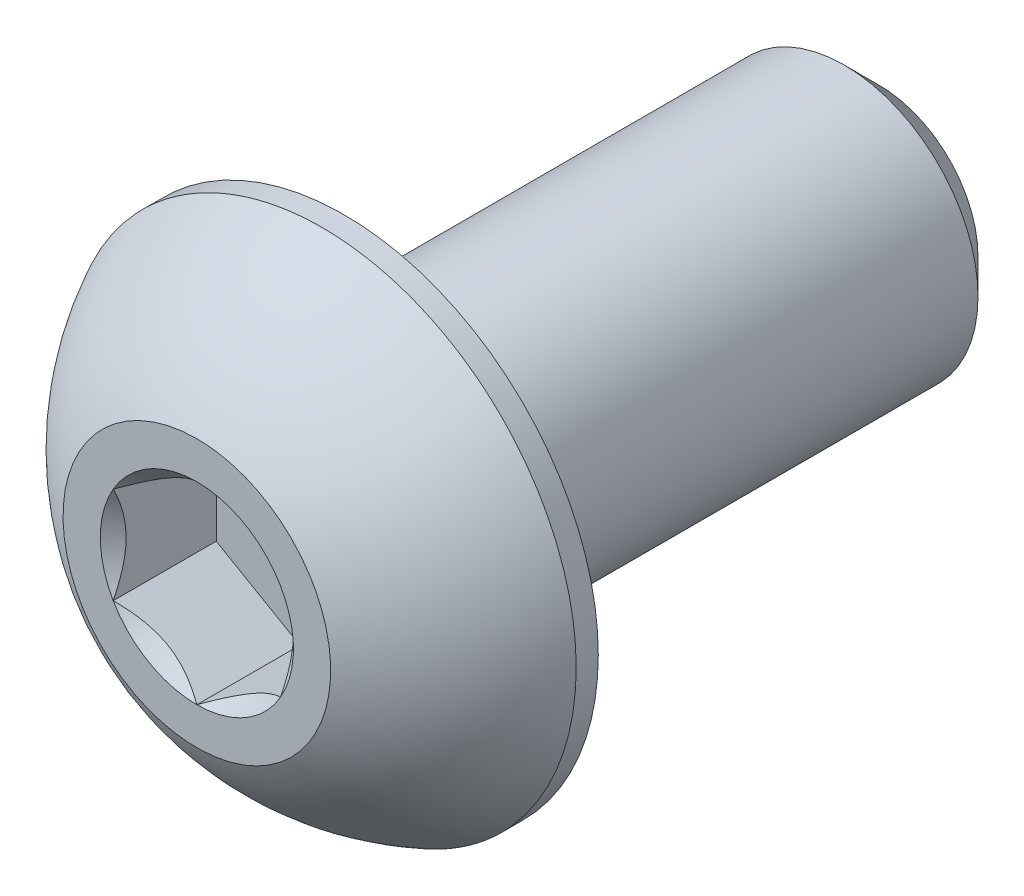
ISO-10303-21;
HEADER;
FILE_DESCRIPTION(('STEP AP214'),'2;1');
FILE_NAME('part.step','',(''),(''),'','','');
FILE_SCHEMA(('AUTOMOTIVE_DESIGN { 1 0 10303 214 1 1 1 1 }'));
ENDSEC;
DATA;
#1=APPLICATION_CONTEXT('core data for automotive mechanical design processes');
#2=APPLICATION_PROTOCOL_DEFINITION('international standard','automotive_design',2000,#1);
#3=PRODUCT_CONTEXT('',#1,'mechanical');
#4=PRODUCT('Part','Part','',(#3));
#5=PRODUCT_RELATED_PRODUCT_CATEGORY('part','',(#4));
#6=PRODUCT_DEFINITION_FORMATION('','',#4);
#7=PRODUCT_DEFINITION_CONTEXT('part definition',#1,'design');
#8=PRODUCT_DEFINITION('design','',#6,#7);
#9=PRODUCT_DEFINITION_SHAPE('','',#8);
#10=(LENGTH_UNIT() NAMED_UNIT(*) SI_UNIT(.MILLI.,.METRE.));
#11=(NAMED_UNIT(*) PLANE_ANGLE_UNIT() SI_UNIT($,.RADIAN.));
#12=(NAMED_UNIT(*) SI_UNIT($,.STERADIAN.) SOLID_ANGLE_UNIT());
#13=UNCERTAINTY_MEASURE_WITH_UNIT(LENGTH_MEASURE(1.E-05),#10,'distance_accuracy_value','');
#14=(GEOMETRIC_REPRESENTATION_CONTEXT(3) GLOBAL_UNCERTAINTY_ASSIGNED_CONTEXT((#13)) GLOBAL_UNIT_ASSIGNED_CONTEXT((#10,
#11,#12)) REPRESENTATION_CONTEXT('',''));
#15=CARTESIAN_POINT('',(0.,0.,0.));
#16=DIRECTION('',(0.,0.,1.));
#17=DIRECTION('',(1.,0.,0.));
#18=AXIS2_PLACEMENT_3D('',#15,#16,#17);
#19=CARTESIAN_POINT('',(1.25,-0.721687836487032,-1.54));
#20=DIRECTION('',(0.,0.,1.));
#21=DIRECTION('',(1.,0.,0.));
#22=AXIS2_PLACEMENT_3D('',#19,#20,#21);
#23=PLANE('',#22);
#24=DIRECTION('',(0.,1.,0.));
#25=VECTOR('',#24,1.);
#26=CARTESIAN_POINT('',(-1.25,0.721687836487032,-1.54));
#27=LINE('',#26,#25);
#28=CARTESIAN_POINT('',(-1.25,0.721687836487031,-1.54));
#29=VERTEX_POINT('',#28);
#30=CARTESIAN_POINT('',(-1.25,-0.721687836487032,-1.54));
#31=VERTEX_POINT('',#30);
#32=EDGE_CURVE('E67',#29,#31,#27,.F.);
#33=ORIENTED_EDGE('',*,*,#32,.T.);
#34=DIRECTION('',(0.866025403784439,-0.5,0.));
#35=VECTOR('',#34,1.);
#36=CARTESIAN_POINT('',(-1.25,-0.721687836487032,-1.54));
#37=LINE('',#36,#35);
#38=CARTESIAN_POINT('',(0.,-1.44337567297406,-1.54));
#39=VERTEX_POINT('',#38);
#40=EDGE_CURVE('E81',#31,#39,#37,.T.);
#41=ORIENTED_EDGE('',*,*,#40,.T.);
#42=DIRECTION('',(0.866025403784438,0.5,0.));
#43=VECTOR('',#42,1.);
#44=CARTESIAN_POINT('',(0.,-1.44337567297406,-1.54));
#45=LINE('',#44,#43);
#46=CARTESIAN_POINT('',(1.25,-0.721687836487032,-1.54));
#47=VERTEX_POINT('',#46);
#48=EDGE_CURVE('E84',#39,#47,#45,.T.);
#49=ORIENTED_EDGE('',*,*,#48,.T.);
#50=DIRECTION('',(0.,1.,0.));
#51=VECTOR('',#50,1.);
#52=CARTESIAN_POINT('',(1.25,-0.721687836487032,-1.54));
#53=LINE('',#52,#51);
#54=CARTESIAN_POINT('',(1.25,0.721687836487033,-1.54));
#55=VERTEX_POINT('',#54);
#56=EDGE_CURVE('E93',#47,#55,#53,.T.);
#57=ORIENTED_EDGE('',*,*,#56,.T.);
#58=DIRECTION('',(-0.866025403784439,0.5,0.));
#59=VECTOR('',#58,1.);
#60=CARTESIAN_POINT('',(1.25,0.721687836487033,-1.54));
#61=LINE('',#60,#59);
#62=CARTESIAN_POINT('',(0.,1.44337567297406,-1.54));
#63=VERTEX_POINT('',#62);
#64=EDGE_CURVE('E265',#55,#63,#61,.T.);
#65=ORIENTED_EDGE('',*,*,#64,.T.);
#66=DIRECTION('',(-0.866025403784438,-0.5,0.));
#67=VECTOR('',#66,1.);
#68=CARTESIAN_POINT('',(0.,1.44337567297406,-1.54));
#69=LINE('',#68,#67);
#70=EDGE_CURVE('E72',#63,#29,#69,.T.);
#71=ORIENTED_EDGE('',*,*,#70,.T.);
#72=EDGE_LOOP('',(#33,#41,#49,#57,#65,#71));
#73=FACE_BOUND('',#72,.T.);
#74=ADVANCED_FACE('F17',(#73),#23,.T.);
#75=CARTESIAN_POINT('',(-1.25,-0.721687836487032,-1.54));
#76=DIRECTION('',(-0.5,-0.866025403784439,0.));
#77=DIRECTION('',(0.866025403784439,-0.5,0.));
#78=AXIS2_PLACEMENT_3D('',#75,#76,#77);
#79=PLANE('',#78);
#80=CARTESIAN_POINT('',(-1.2500000000016,-0.721687836486111,-2.26836178063198E-12));
#81=CARTESIAN_POINT('',(-1.20703689150833,-0.74649259873992,-0.0247809602853257));
#82=CARTESIAN_POINT('',(-1.1633554359775,-0.771712098849238,-0.0481062505422106));
#83=CARTESIAN_POINT('',(-1.07428446548141,-0.823137247642137,-0.0908138610995847));
#84=CARTESIAN_POINT('',(-1.02888648449087,-0.849347784187693,-0.110172426663462));
#85=CARTESIAN_POINT('',(-0.937343688598987,-0.902200042038242,-0.143333784117164));
#86=CARTESIAN_POINT('',(-0.891222174228788,-0.92882831077531,-0.15721990325138));
#87=CARTESIAN_POINT('',(-0.79796403899848,-0.982670920254651,-0.178614098245694));
#88=CARTESIAN_POINT('',(-0.750830265050418,-1.00988361733149,-0.186138138130082));
#89=CARTESIAN_POINT('',(-0.669590913661114,-1.05678717872489,-0.192927172266352));
#90=CARTESIAN_POINT('',(-0.635590178136799,-1.0764175125325,-0.19393181141306));
#91=CARTESIAN_POINT('',(-0.567648554853576,-1.11564362702425,-0.192236504858619));
#92=CARTESIAN_POINT('',(-0.533707681972964,-1.1352393991184,-0.189535740825175));
#93=CARTESIAN_POINT('',(-0.466153619951155,-1.17424175501155,-0.180585751756811));
#94=CARTESIAN_POINT('',(-0.432540765124883,-1.19364814579373,-0.174333227052609));
#95=CARTESIAN_POINT('',(-0.365876261008733,-1.23213691519058,-0.158616460881214));
#96=CARTESIAN_POINT('',(-0.332824858931062,-1.25121915107722,-0.149150841277129));
#97=CARTESIAN_POINT('',(-0.24821357015969,-1.30006950142585,-0.121071668556236));
#98=CARTESIAN_POINT('',(-0.197186124607517,-1.32953021085146,-0.100350655055702));
#99=CARTESIAN_POINT('',(-0.0971276057052171,-1.38729902367441,-0.0536764942537948));
#100=CARTESIAN_POINT('',(-0.0480906425773457,-1.41561052753653,-0.0277403788128112));
#101=CARTESIAN_POINT('',(1.59655497120924E-12,-1.44337567297499,-2.26830546905102E-12));
#102=B_SPLINE_CURVE_WITH_KNOTS('',3,(#80,#81,#82,#83,#84,#85,#86,#87,#88,#89,#90,#91,#92,#93,
#94,#95,#96,#97,#98,#99,#100,#101),.UNSPECIFIED.,.F.,.F.,(4,2,2,2,2,2,2,2,2,2,4),(0.,
0.166478683193945,0.333926926769032,0.498716658424013,0.663091654503517,0.780745575390527,
0.89842548413854,1.01621489951224,1.13405490022132,1.3211159162831,1.5075756576265),.UNSPECIFIED.);
#103=CARTESIAN_POINT('',(-1.25000000000138,-0.72168783648783,-1.59483069292473E-12));
#104=VERTEX_POINT('',#103);
#105=CARTESIAN_POINT('',(-1.96732798956771E-12,-1.44337567297612,-1.1341344691766E-12));
#106=VERTEX_POINT('',#105);
#107=EDGE_CURVE('E20',#104,#106,#102,.T.);
#108=ORIENTED_EDGE('',*,*,#107,.T.);
#109=DIRECTION('',(0.,0.,1.));
#110=VECTOR('',#109,1.);
#111=CARTESIAN_POINT('',(0.,-1.44337567297406,-1.54));
#112=LINE('',#111,#110);
#113=EDGE_CURVE('E88',#106,#39,#112,.F.);
#114=ORIENTED_EDGE('',*,*,#113,.T.);
#115=ORIENTED_EDGE('',*,*,#40,.F.);
#116=DIRECTION('',(0.,0.,1.));
#117=VECTOR('',#116,1.);
#118=CARTESIAN_POINT('',(-1.25,-0.721687836487032,-1.54));
#119=LINE('',#118,#117);
#120=EDGE_CURVE('E59',#31,#104,#119,.T.);
#121=ORIENTED_EDGE('',*,*,#120,.T.);
#122=EDGE_LOOP('',(#108,#114,#115,#121));
#123=FACE_BOUND('',#122,.T.);
#124=ADVANCED_FACE('F89',(#123),#79,.F.);
#125=CARTESIAN_POINT('',(0.,-1.44337567297406,-1.54));
#126=DIRECTION('',(0.5,-0.866025403784438,0.));
#127=DIRECTION('',(0.866025403784438,0.5,0.));
#128=AXIS2_PLACEMENT_3D('',#125,#126,#127);
#129=PLANE('',#128);
#130=CARTESIAN_POINT('',(-1.59927432460088E-12,-1.44337567297498,-2.27031168720241E-12));
#131=CARTESIAN_POINT('',(0.0429631084916656,-1.41857091072117,-0.0247809602853281));
#132=CARTESIAN_POINT('',(0.0866445640224934,-1.39335141061186,-0.0481062505422131));
#133=CARTESIAN_POINT('',(0.175715534518584,-1.34192626181896,-0.0908138610995873));
#134=CARTESIAN_POINT('',(0.221113515509127,-1.3157157252734,-0.110172426663465));
#135=CARTESIAN_POINT('',(0.31265631140101,-1.26286346742285,-0.143333784117167));
#136=CARTESIAN_POINT('',(0.358777825771209,-1.23623519868578,-0.157219903251383));
#137=CARTESIAN_POINT('',(0.452035961001518,-1.18239258920644,-0.178614098245698));
#138=CARTESIAN_POINT('',(0.499169734949579,-1.15517989212961,-0.186138138130085));
#139=CARTESIAN_POINT('',(0.580409086338884,-1.1082763307362,-0.192927172266355));
#140=CARTESIAN_POINT('',(0.614409821863198,-1.08864599692859,-0.193931811413064));
#141=CARTESIAN_POINT('',(0.682351445146421,-1.04941988243684,-0.192236504858622));
#142=CARTESIAN_POINT('',(0.716292318027033,-1.02982411034269,-0.189535740825178));
#143=CARTESIAN_POINT('',(0.783846380048841,-0.990821754449548,-0.180585751756815));
#144=CARTESIAN_POINT('',(0.817459234875114,-0.971415363667367,-0.174333227052613));
#145=CARTESIAN_POINT('',(0.884123738991264,-0.932926594270515,-0.158616460881217));
#146=CARTESIAN_POINT('',(0.917175141068935,-0.913844358383877,-0.149150841277132));
#147=CARTESIAN_POINT('',(1.00178642984031,-0.864994008035244,-0.121071668556239));
#148=CARTESIAN_POINT('',(1.05281387539248,-0.835533298609638,-0.100350655055706));
#149=CARTESIAN_POINT('',(1.15287239429478,-0.77776448578668,-0.0536764942537982));
#150=CARTESIAN_POINT('',(1.20190935742265,-0.749452981924561,-0.0277403788128144));
#151=CARTESIAN_POINT('',(1.25000000000159,-0.721687836486107,-2.271252521862E-12));
#152=B_SPLINE_CURVE_WITH_KNOTS('',3,(#130,#131,#132,#133,#134,#135,#136,#137,#138,#139,#140,
#141,#142,#143,#144,#145,#146,#147,#148,#149,#150,#151),.UNSPECIFIED.,.F.,.F.,(4,2,2,2,2,2,2,2,
2,2,4),(0.,0.166478683193946,0.333926926769033,0.498716658424015,0.663091654503519,
0.780745575390529,0.898425484138542,1.01621489951224,1.13405490022132,1.3211159162831,
1.5075756576265),.UNSPECIFIED.);
#153=CARTESIAN_POINT('',(1.2500000000008,-0.721687836489759,-1.13558355513166E-12));
#154=VERTEX_POINT('',#153);
#155=EDGE_CURVE('E202',#106,#154,#152,.T.);
#156=ORIENTED_EDGE('',*,*,#155,.T.);
#157=DIRECTION('',(0.,0.,-1.));
#158=VECTOR('',#157,1.);
#159=CARTESIAN_POINT('',(1.25,-0.721687836487033,-1.54));
#160=LINE('',#159,#158);
#161=EDGE_CURVE('E97',#154,#47,#160,.T.);
#162=ORIENTED_EDGE('',*,*,#161,.T.);
#163=ORIENTED_EDGE('',*,*,#48,.F.);
#164=ORIENTED_EDGE('',*,*,#113,.F.);
#165=EDGE_LOOP('',(#156,#162,#163,#164));
#166=FACE_BOUND('',#165,.T.);
#167=ADVANCED_FACE('F95',(#166),#129,.F.);
#168=CARTESIAN_POINT('',(1.25,-0.721687836487032,-1.54));
#169=DIRECTION('',(1.,0.,0.));
#170=DIRECTION('',(0.,0.,-1.));
#171=AXIS2_PLACEMENT_3D('',#168,#169,#170);
#172=PLANE('',#171);
#173=CARTESIAN_POINT('',(1.25,-0.721687836488875,-2.26795896550859E-12));
#174=CARTESIAN_POINT('',(1.25,-0.672078311968734,-0.0247809602843525));
#175=CARTESIAN_POINT('',(1.25,-0.621639311737501,-0.0481062505397484));
#176=CARTESIAN_POINT('',(1.25,-0.518789014126518,-0.090813861092757));
#177=CARTESIAN_POINT('',(1.25,-0.466367941022824,-0.110172426653755));
#178=CARTESIAN_POINT('',(1.25,-0.360663425297222,-0.143333784099996));
#179=CARTESIAN_POINT('',(1.25,-0.307406887811172,-0.157219903229683));
#180=CARTESIAN_POINT('',(1.25,-0.199721668829271,-0.178614098213362));
#181=CARTESIAN_POINT('',(1.25,-0.145296274664292,-0.186138138091646));
#182=CARTESIAN_POINT('',(1.25,-0.0514891518512715,-0.192927172217059));
#183=CARTESIAN_POINT('',(1.25,-0.0122284842208856,-0.193931811358571));
#184=CARTESIAN_POINT('',(1.25,0.0662237447923831,-0.192236504792061));
#185=CARTESIAN_POINT('',(1.25,0.105415288995289,-0.189535740751742));
#186=CARTESIAN_POINT('',(1.25,0.183420000810114,-0.180585751668417));
#187=CARTESIAN_POINT('',(1.25,0.22223278238841,-0.174333226956125));
#188=CARTESIAN_POINT('',(1.25,0.29921032120936,-0.158616460767833));
#189=CARTESIAN_POINT('',(1.25,0.337374792995945,-0.149150841154941));
#190=CARTESIAN_POINT('',(1.25,0.43507549364919,-0.121071668433228));
#191=CARTESIAN_POINT('',(1.25,0.493996912445358,-0.100350654949518));
#192=CARTESIAN_POINT('',(1.25,0.609534537985814,-0.0536764941931687));
#193=CARTESIAN_POINT('',(1.25,0.666157545659631,-0.0277403787809138));
#194=CARTESIAN_POINT('',(1.25,0.721687836488875,-2.26787696339759E-12));
#195=B_SPLINE_CURVE_WITH_KNOTS('',3,(#173,#174,#175,#176,#177,#178,#179,#180,#181,#182,#183,
#184,#185,#186,#187,#188,#189,#190,#191,#192,#193,#194),.UNSPECIFIED.,.F.,.F.,(4,2,2,2,2,2,2,2,
2,2,4),(0.,0.166478683226287,0.333926926833724,0.498716658519756,0.663091654630285,
0.780745575562284,0.89842548435534,1.01621489977414,1.13405490052833,1.3211159164188,
1.50757565759031),.UNSPECIFIED.);
#196=CARTESIAN_POINT('',(1.25000000000276,0.72168783648636,-1.13395259608091E-12));
#197=VERTEX_POINT('',#196);
#198=EDGE_CURVE('E184',#154,#197,#195,.T.);
#199=ORIENTED_EDGE('',*,*,#198,.T.);
#200=DIRECTION('',(0.,0.,1.));
#201=VECTOR('',#200,1.);
#202=CARTESIAN_POINT('',(1.25,0.721687836487033,-1.54));
#203=LINE('',#202,#201);
#204=EDGE_CURVE('E262',#197,#55,#203,.F.);
#205=ORIENTED_EDGE('',*,*,#204,.T.);
#206=ORIENTED_EDGE('',*,*,#56,.F.);
#207=ORIENTED_EDGE('',*,*,#161,.F.);
#208=EDGE_LOOP('',(#199,#205,#206,#207));
#209=FACE_BOUND('',#208,.T.);
#210=ADVANCED_FACE('F174',(#209),#172,.F.);
#211=CARTESIAN_POINT('',(1.25,0.721687836487033,-1.54));
#212=DIRECTION('',(0.5,0.866025403784439,0.));
#213=DIRECTION('',(-0.866025403784439,0.5,0.));
#214=AXIS2_PLACEMENT_3D('',#211,#212,#213);
#215=PLANE('',#214);
#216=CARTESIAN_POINT('',(1.2500000000016,0.721687836486112,-2.26779275057892E-12));
#217=CARTESIAN_POINT('',(1.20703689150833,0.746492598739921,-0.0247809602853253));
#218=CARTESIAN_POINT('',(1.1633554359775,0.771712098849239,-0.0481062505422101));
#219=CARTESIAN_POINT('',(1.07428446548141,0.823137247642138,-0.090813861099584));
#220=CARTESIAN_POINT('',(1.02888648449087,0.849347784187694,-0.110172426663462));
#221=CARTESIAN_POINT('',(0.937343688598988,0.902200042038243,-0.143333784117164));
#222=CARTESIAN_POINT('',(0.891222174228788,0.928828310775311,-0.157219903251379));
#223=CARTESIAN_POINT('',(0.79796403899848,0.982670920254652,-0.178614098245693));
#224=CARTESIAN_POINT('',(0.750830265050419,1.00988361733149,-0.186138138130081));
#225=CARTESIAN_POINT('',(0.669590913661114,1.05678717872489,-0.192927172266351));
#226=CARTESIAN_POINT('',(0.6355901781368,1.0764175125325,-0.193931811413059));
#227=CARTESIAN_POINT('',(0.567648554853577,1.11564362702425,-0.192236504858618));
#228=CARTESIAN_POINT('',(0.533707681972964,1.1352393991184,-0.189535740825174));
#229=CARTESIAN_POINT('',(0.466153619951156,1.17424175501155,-0.18058575175681));
#230=CARTESIAN_POINT('',(0.432540765124884,1.19364814579373,-0.174333227052608));
#231=CARTESIAN_POINT('',(0.365876261008733,1.23213691519058,-0.158616460881213));
#232=CARTESIAN_POINT('',(0.332824858931062,1.25121915107722,-0.149150841277128));
#233=CARTESIAN_POINT('',(0.24821357015969,1.30006950142585,-0.121071668556235));
#234=CARTESIAN_POINT('',(0.197186124607517,1.32953021085146,-0.100350655055701));
#235=CARTESIAN_POINT('',(0.0971276057052179,1.38729902367441,-0.0536764942537943));
#236=CARTESIAN_POINT('',(0.0480906425773466,1.41561052753653,-0.0277403788128107));
#237=CARTESIAN_POINT('',(-1.59549932784665E-12,1.44337567297499,-2.26778926334573E-12));
#238=B_SPLINE_CURVE_WITH_KNOTS('',3,(#216,#217,#218,#219,#220,#221,#222,#223,#224,#225,#226,
#227,#228,#229,#230,#231,#232,#233,#234,#235,#236,#237),.UNSPECIFIED.,.F.,.F.,(4,2,2,2,2,2,2,2,
2,2,4),(0.,0.166478683193945,0.333926926769031,0.498716658424013,0.663091654503517,
0.780745575390526,0.898425484138539,1.01621489951224,1.13405490022132,1.32111591628309,
1.5075756576265),.UNSPECIFIED.);
#239=CARTESIAN_POINT('',(1.96785442637201E-12,1.44337567297612,-1.1338136091029E-12));
#240=VERTEX_POINT('',#239);
#241=EDGE_CURVE('E178',#197,#240,#238,.T.);
#242=ORIENTED_EDGE('',*,*,#241,.T.);
#243=DIRECTION('',(0.,0.,1.));
#244=VECTOR('',#243,1.);
#245=CARTESIAN_POINT('',(0.,1.44337567297406,-1.54));
#246=LINE('',#245,#244);
#247=EDGE_CURVE('E257',#240,#63,#246,.F.);
#248=ORIENTED_EDGE('',*,*,#247,.T.);
#249=ORIENTED_EDGE('',*,*,#64,.F.);
#250=ORIENTED_EDGE('',*,*,#204,.F.);
#251=EDGE_LOOP('',(#242,#248,#249,#250));
#252=FACE_BOUND('',#251,.T.);
#253=ADVANCED_FACE('F170',(#252),#215,.F.);
#254=CARTESIAN_POINT('',(0.,1.44337567297406,-1.54));
#255=DIRECTION('',(-0.5,0.866025403784438,0.));
#256=DIRECTION('',(-0.866025403784438,-0.5,0.));
#257=AXIS2_PLACEMENT_3D('',#254,#255,#256);
#258=PLANE('',#257);
#259=CARTESIAN_POINT('',(1.59942300893385E-12,1.44337567297498,-2.27020150660554E-12));
#260=CARTESIAN_POINT('',(-0.0429631084916655,1.41857091072117,-0.024780960285328));
#261=CARTESIAN_POINT('',(-0.0866445640224934,1.39335141061186,-0.048106250542213));
#262=CARTESIAN_POINT('',(-0.175715534518584,1.34192626181896,-0.0908138610995872));
#263=CARTESIAN_POINT('',(-0.221113515509127,1.3157157252734,-0.110172426663465));
#264=CARTESIAN_POINT('',(-0.31265631140101,1.26286346742285,-0.143333784117167));
#265=CARTESIAN_POINT('',(-0.358777825771209,1.23623519868578,-0.157219903251383));
#266=CARTESIAN_POINT('',(-0.452035961001517,1.18239258920644,-0.178614098245697));
#267=CARTESIAN_POINT('',(-0.499169734949579,1.15517989212961,-0.186138138130085));
#268=CARTESIAN_POINT('',(-0.580409086338884,1.1082763307362,-0.192927172266355));
#269=CARTESIAN_POINT('',(-0.614409821863198,1.08864599692859,-0.193931811413064));
#270=CARTESIAN_POINT('',(-0.682351445146421,1.04941988243684,-0.192236504858623));
#271=CARTESIAN_POINT('',(-0.716292318027033,1.02982411034269,-0.189535740825178));
#272=CARTESIAN_POINT('',(-0.783846380048841,0.990821754449548,-0.180585751756815));
#273=CARTESIAN_POINT('',(-0.817459234875113,0.971415363667368,-0.174333227052613));
#274=CARTESIAN_POINT('',(-0.884123738991264,0.932926594270515,-0.158616460881218));
#275=CARTESIAN_POINT('',(-0.917175141068934,0.913844358383877,-0.149150841277132));
#276=CARTESIAN_POINT('',(-1.00178642984031,0.864994008035244,-0.121071668556239));
#277=CARTESIAN_POINT('',(-1.05281387539248,0.835533298609638,-0.100350655055706));
#278=CARTESIAN_POINT('',(-1.15287239429478,0.77776448578668,-0.0536764942537981));
#279=CARTESIAN_POINT('',(-1.20190935742265,0.749452981924561,-0.0277403788128142));
#280=CARTESIAN_POINT('',(-1.2500000000016,0.721687836486107,-2.27090905106569E-12));
#281=B_SPLINE_CURVE_WITH_KNOTS('',3,(#259,#260,#261,#262,#263,#264,#265,#266,#267,#268,#269,
#270,#271,#272,#273,#274,#275,#276,#277,#278,#279,#280),.UNSPECIFIED.,.F.,.F.,(4,2,2,2,2,2,2,2,
2,2,4),(0.,0.166478683193946,0.333926926769033,0.498716658424015,0.663091654503519,
0.780745575390529,0.898425484138542,1.01621489951224,1.13405490022132,1.3211159162831,
1.5075756576265),.UNSPECIFIED.);
#282=CARTESIAN_POINT('',(-1.2500000000008,0.721687836489759,-1.13546932469246E-12));
#283=VERTEX_POINT('',#282);
#284=EDGE_CURVE('E40',#240,#283,#281,.T.);
#285=ORIENTED_EDGE('',*,*,#284,.T.);
#286=DIRECTION('',(0.,0.,1.));
#287=VECTOR('',#286,1.);
#288=CARTESIAN_POINT('',(-1.25,0.721687836487032,-1.54));
#289=LINE('',#288,#287);
#290=EDGE_CURVE('E250',#283,#29,#289,.F.);
#291=ORIENTED_EDGE('',*,*,#290,.T.);
#292=ORIENTED_EDGE('',*,*,#70,.F.);
#293=ORIENTED_EDGE('',*,*,#247,.F.);
#294=EDGE_LOOP('',(#285,#291,#292,#293));
#295=FACE_BOUND('',#294,.T.);
#296=ADVANCED_FACE('F163',(#295),#258,.F.);
#297=CARTESIAN_POINT('',(-1.25,0.721687836487032,-1.54));
#298=DIRECTION('',(-1.,0.,0.));
#299=DIRECTION('',(0.,0.,1.));
#300=AXIS2_PLACEMENT_3D('',#297,#298,#299);
#301=PLANE('',#300);
#302=CARTESIAN_POINT('',(-1.25,0.721687836488874,-2.26828266931606E-12));
#303=CARTESIAN_POINT('',(-1.25,0.672078311968734,-0.0247809602843528));
#304=CARTESIAN_POINT('',(-1.25,0.6216393117375,-0.0481062505397487));
#305=CARTESIAN_POINT('',(-1.25,0.518789014126518,-0.0908138610927572));
#306=CARTESIAN_POINT('',(-1.25,0.466367941022823,-0.110172426653755));
#307=CARTESIAN_POINT('',(-1.25,0.360663425297222,-0.143333784099996));
#308=CARTESIAN_POINT('',(-1.25,0.307406887811172,-0.157219903229683));
#309=CARTESIAN_POINT('',(-1.25,0.199721668829271,-0.178614098213362));
#310=CARTESIAN_POINT('',(-1.25,0.145296274664291,-0.186138138091646));
#311=CARTESIAN_POINT('',(-1.25,0.0514891518512714,-0.192927172217059));
#312=CARTESIAN_POINT('',(-1.25,0.0122284842208855,-0.193931811358571));
#313=CARTESIAN_POINT('',(-1.25,-0.0662237447923832,-0.192236504792061));
#314=CARTESIAN_POINT('',(-1.25,-0.105415288995289,-0.189535740751742));
#315=CARTESIAN_POINT('',(-1.25,-0.183420000810114,-0.180585751668417));
#316=CARTESIAN_POINT('',(-1.25,-0.22223278238841,-0.174333226956125));
#317=CARTESIAN_POINT('',(-1.25,-0.29921032120936,-0.158616460767833));
#318=CARTESIAN_POINT('',(-1.25,-0.337374792995945,-0.149150841154941));
#319=CARTESIAN_POINT('',(-1.25,-0.43507549364919,-0.121071668433228));
#320=CARTESIAN_POINT('',(-1.25,-0.493996912445358,-0.100350654949518));
#321=CARTESIAN_POINT('',(-1.25,-0.609534537985814,-0.0536764941931687));
#322=CARTESIAN_POINT('',(-1.25,-0.666157545659631,-0.0277403787809137));
#323=CARTESIAN_POINT('',(-1.25,-0.721687836488875,-2.26787707066826E-12));
#324=B_SPLINE_CURVE_WITH_KNOTS('',3,(#302,#303,#304,#305,#306,#307,#308,#309,#310,#311,#312,
#313,#314,#315,#316,#317,#318,#319,#320,#321,#322,#323),.UNSPECIFIED.,.F.,.F.,(4,2,2,2,2,2,2,2,
2,2,4),(0.,0.166478683226287,0.333926926833723,0.498716658519755,0.663091654630285,
0.780745575562283,0.89842548435534,1.01621489977414,1.13405490052833,1.3211159164188,
1.50757565759031),.UNSPECIFIED.);
#325=EDGE_CURVE('E143',#283,#104,#324,.T.);
#326=ORIENTED_EDGE('',*,*,#325,.T.);
#327=ORIENTED_EDGE('',*,*,#120,.F.);
#328=ORIENTED_EDGE('',*,*,#32,.F.);
#329=ORIENTED_EDGE('',*,*,#290,.F.);
#330=EDGE_LOOP('',(#326,#327,#328,#329));
#331=FACE_BOUND('',#330,.T.);
#332=ADVANCED_FACE('F159',(#331),#301,.F.);
#333=CARTESIAN_POINT('',(0.,0.,-5.6843418860808E-11));
#334=DIRECTION('',(0.,0.,1.));
#335=DIRECTION('',(1.,0.,0.));
#336=AXIS2_PLACEMENT_3D('',#333,#334,#335);
#337=CONICAL_SURFACE('',#336,1.44337567292041,0.78539816325135);
#338=ORIENTED_EDGE('',*,*,#107,.F.);
#339=CARTESIAN_POINT('',(0.,0.,0.));
#340=DIRECTION('',(0.,0.,1.));
#341=DIRECTION('',(1.,0.,0.));
#342=AXIS2_PLACEMENT_3D('',#339,#340,#341);
#343=CIRCLE('',#342,1.44337567297725);
#344=EDGE_CURVE('E151',#104,#106,#343,.T.);
#345=ORIENTED_EDGE('',*,*,#344,.T.);
#346=EDGE_LOOP('',(#338,#345));
#347=FACE_BOUND('',#346,.T.);
#348=ADVANCED_FACE('F162',(#347),#337,.F.);
#349=CARTESIAN_POINT('',(0.,0.,-5.6843418860808E-11));
#350=DIRECTION('',(0.,0.,1.));
#351=DIRECTION('',(1.,0.,0.));
#352=AXIS2_PLACEMENT_3D('',#349,#350,#351);
#353=CONICAL_SURFACE('',#352,1.44337567292041,0.78539816325135);
#354=ORIENTED_EDGE('',*,*,#155,.F.);
#355=CARTESIAN_POINT('',(0.,0.,0.));
#356=DIRECTION('',(0.,0.,1.));
#357=DIRECTION('',(1.,0.,0.));
#358=AXIS2_PLACEMENT_3D('',#355,#356,#357);
#359=CIRCLE('',#358,1.44337567297725);
#360=EDGE_CURVE('E303',#106,#154,#359,.T.);
#361=ORIENTED_EDGE('',*,*,#360,.T.);
#362=EDGE_LOOP('',(#354,#361));
#363=FACE_BOUND('',#362,.T.);
#364=ADVANCED_FACE('F197',(#363),#353,.F.);
#365=CARTESIAN_POINT('',(0.,0.,-5.6843418860808E-11));
#366=DIRECTION('',(0.,0.,1.));
#367=DIRECTION('',(1.,0.,0.));
#368=AXIS2_PLACEMENT_3D('',#365,#366,#367);
#369=CONICAL_SURFACE('',#368,1.44337567292041,0.785398163397448);
#370=CARTESIAN_POINT('',(0.,0.,0.));
#371=DIRECTION('',(0.,0.,1.));
#372=DIRECTION('',(1.,0.,0.));
#373=AXIS2_PLACEMENT_3D('',#370,#371,#372);
#374=CIRCLE('',#373,1.44337567297725);
#375=EDGE_CURVE('E304',#154,#197,#374,.T.);
#376=ORIENTED_EDGE('',*,*,#375,.T.);
#377=ORIENTED_EDGE('',*,*,#198,.F.);
#378=EDGE_LOOP('',(#376,#377));
#379=FACE_BOUND('',#378,.T.);
#380=ADVANCED_FACE('F193',(#379),#369,.F.);
#381=CARTESIAN_POINT('',(0.,0.,-5.6843418860808E-11));
#382=DIRECTION('',(0.,0.,1.));
#383=DIRECTION('',(1.,0.,0.));
#384=AXIS2_PLACEMENT_3D('',#381,#382,#383);
#385=CONICAL_SURFACE('',#384,1.44337567292041,0.78539816325135);
#386=ORIENTED_EDGE('',*,*,#241,.F.);
#387=CARTESIAN_POINT('',(0.,0.,0.));
#388=DIRECTION('',(0.,0.,1.));
#389=DIRECTION('',(1.,0.,0.));
#390=AXIS2_PLACEMENT_3D('',#387,#388,#389);
#391=CIRCLE('',#390,1.44337567297725);
#392=EDGE_CURVE('E305',#197,#240,#391,.T.);
#393=ORIENTED_EDGE('',*,*,#392,.T.);
#394=EDGE_LOOP('',(#386,#393));
#395=FACE_BOUND('',#394,.T.);
#396=ADVANCED_FACE('F190',(#395),#385,.F.);
#397=CARTESIAN_POINT('',(0.,0.,-5.6843418860808E-11));
#398=DIRECTION('',(0.,0.,1.));
#399=DIRECTION('',(1.,0.,0.));
#400=AXIS2_PLACEMENT_3D('',#397,#398,#399);
#401=CONICAL_SURFACE('',#400,1.44337567292041,0.78539816325135);
#402=ORIENTED_EDGE('',*,*,#284,.F.);
#403=CARTESIAN_POINT('',(0.,0.,0.));
#404=DIRECTION('',(0.,0.,1.));
#405=DIRECTION('',(1.,0.,0.));
#406=AXIS2_PLACEMENT_3D('',#403,#404,#405);
#407=CIRCLE('',#406,1.44337567297725);
#408=EDGE_CURVE('E298',#240,#283,#407,.T.);
#409=ORIENTED_EDGE('',*,*,#408,.T.);
#410=EDGE_LOOP('',(#402,#409));
#411=FACE_BOUND('',#410,.T.);
#412=ADVANCED_FACE('F138',(#411),#401,.F.);
#413=CARTESIAN_POINT('',(0.,0.,-5.6843418860808E-11));
#414=DIRECTION('',(0.,0.,1.));
#415=DIRECTION('',(1.,0.,0.));
#416=AXIS2_PLACEMENT_3D('',#413,#414,#415);
#417=CONICAL_SURFACE('',#416,1.44337567292041,0.785398163397448);
#418=ORIENTED_EDGE('',*,*,#325,.F.);
#419=CARTESIAN_POINT('',(0.,0.,0.));
#420=DIRECTION('',(0.,0.,1.));
#421=DIRECTION('',(1.,0.,0.));
#422=AXIS2_PLACEMENT_3D('',#419,#420,#421);
#423=CIRCLE('',#422,1.44337567297725);
#424=EDGE_CURVE('E123',#283,#104,#423,.T.);
#425=ORIENTED_EDGE('',*,*,#424,.T.);
#426=EDGE_LOOP('',(#418,#425));
#427=FACE_BOUND('',#426,.T.);
#428=ADVANCED_FACE('F133',(#427),#417,.F.);
#429=CARTESIAN_POINT('',(0.,-2.,0.));
#430=DIRECTION('',(0.,0.,-1.));
#431=DIRECTION('',(-1.,0.,0.));
#432=AXIS2_PLACEMENT_3D('',#429,#430,#431);
#433=PLANE('',#432);
#434=ORIENTED_EDGE('',*,*,#408,.F.);
#435=ORIENTED_EDGE('',*,*,#392,.F.);
#436=ORIENTED_EDGE('',*,*,#375,.F.);
#437=ORIENTED_EDGE('',*,*,#360,.F.);
#438=ORIENTED_EDGE('',*,*,#344,.F.);
#439=ORIENTED_EDGE('',*,*,#424,.F.);
#440=EDGE_LOOP('',(#434,#435,#436,#437,#438,#439));
#441=FACE_BOUND('',#440,.T.);
#442=CARTESIAN_POINT('',(0.,2.00000000000001,0.));
#443=CARTESIAN_POINT('',(-0.11234088393291,1.99999501830892,0.));
#444=CARTESIAN_POINT('',(-0.224763225593508,1.99050288387283,2.68231530173461E-13));
#445=CARTESIAN_POINT('',(-0.446511726793878,1.95276859922379,-2.68988498544959E-13));
#446=CARTESIAN_POINT('',(-0.555833994612156,1.92450388247339,-1.01742638839415E-12));
#447=CARTESIAN_POINT('',(-0.768137698049009,1.85002906418694,-9.04674133920845E-13));
#448=CARTESIAN_POINT('',(-0.87112213481957,1.80382753320623,0.));
#449=CARTESIAN_POINT('',(-1.06784380972381,1.69480235085555,0.));
#450=CARTESIAN_POINT('',(-1.1615833392864,1.63198283268135,-7.28149767983077E-13));
#451=CARTESIAN_POINT('',(-1.33719709830381,1.49149220719557,-8.66068322015696E-13));
#452=CARTESIAN_POINT('',(-1.41907008513778,1.41381954648974,-2.31882612333537E-13));
#453=CARTESIAN_POINT('',(-1.56861687177599,1.24582829627508,2.31458026871751E-13));
#454=CARTESIAN_POINT('',(-1.63629011398113,1.1555092103954,0.));
#455=CARTESIAN_POINT('',(-1.75551140838451,0.964793228617698,0.));
#456=CARTESIAN_POINT('',(-1.80705976087957,0.864396520443115,0.));
#457=CARTESIAN_POINT('',(-1.89256952340774,0.656374060165244,0.));
#458=CARTESIAN_POINT('',(-1.92653096880461,0.548748322598581,0.));
#459=CARTESIAN_POINT('',(-1.97590307610689,0.329322588612879,0.));
#460=CARTESIAN_POINT('',(-1.99131370264776,0.217522584236603,0.));
#461=CARTESIAN_POINT('',(-2.0031465752584,-0.00707760750866498,0.));
#462=CARTESIAN_POINT('',(-1.99956885554327,-0.119877793075065,0.));
#463=CARTESIAN_POINT('',(-1.97352667238582,-0.343276528884565,0.));
#464=CARTESIAN_POINT('',(-1.95106220189598,-0.453875078306117,0.));
#465=CARTESIAN_POINT('',(-1.88788417341462,-0.669731048185599,0.));
#466=CARTESIAN_POINT('',(-1.84717059615922,-0.774988463005262,0.));
#467=CARTESIAN_POINT('',(-1.74865010522096,-0.977174053294477,0.));
#468=CARTESIAN_POINT('',(-1.69084319710064,-1.07410223147453,0.));
#469=CARTESIAN_POINT('',(-1.55977703496566,-1.25687784284643,0.));
#470=CARTESIAN_POINT('',(-1.48651778720561,-1.34272528052337,0.));
#471=CARTESIAN_POINT('',(-1.32662653450796,-1.50090251249222,0.));
#472=CARTESIAN_POINT('',(-1.23999452773775,-1.57323230493165,0.));
#473=CARTESIAN_POINT('',(-1.0558169799055,-1.70232101036836,0.));
#474=CARTESIAN_POINT('',(-0.958271437417255,-1.7590799213308,0.));
#475=CARTESIAN_POINT('',(-0.755035863250454,-1.85541563039959,0.));
#476=CARTESIAN_POINT('',(-0.649345831920616,-1.89499242924161,0.));
#477=CARTESIAN_POINT('',(-0.432821510670026,-1.95584044724503,0.));
#478=CARTESIAN_POINT('',(-0.321987220981025,-1.97711166723111,0.));
#479=CARTESIAN_POINT('',(-0.0983206380605834,-2.00074470318098,0.));
#480=CARTESIAN_POINT('',(0.0145116551708554,-2.00310651914479,2.77232105836669E-13));
#481=CARTESIAN_POINT('',(0.238971273328259,-1.98885370171909,-2.77665799204907E-13));
#482=CARTESIAN_POINT('',(0.350598598199939,-1.97223906747468,-1.03620566849867E-12));
#483=CARTESIAN_POINT('',(0.569479507471833,-1.9205049877507,-9.10154068848724E-13));
#484=CARTESIAN_POINT('',(0.676733091684775,-1.8853855414788,0.));
#485=CARTESIAN_POINT('',(0.883821886677241,-1.79763878093744,0.));
#486=CARTESIAN_POINT('',(0.98365709842622,-1.74501146895596,-8.08771094430417E-13));
#487=CARTESIAN_POINT('',(1.17307512321429,-1.62374291867218,-9.48503777159588E-13));
#488=CARTESIAN_POINT('',(1.26265793765837,-1.55510168256445,-2.54336729495504E-13));
#489=CARTESIAN_POINT('',(1.42902822576512,-1.40375377143032,2.53903151485753E-13));
#490=CARTESIAN_POINT('',(1.50581569424864,-1.32104709071072,0.));
#491=CARTESIAN_POINT('',(1.64441549755368,-1.14391608106199,0.));
#492=CARTESIAN_POINT('',(1.70622782750198,-1.04949174831971,0.));
#493=CARTESIAN_POINT('',(1.81312259248704,-0.851605992808598,0.));
#494=CARTESIAN_POINT('',(1.85820504518396,-0.748144579579489,0.));
#495=CARTESIAN_POINT('',(1.93036037779898,-0.535121579788185,0.));
#496=CARTESIAN_POINT('',(1.95743326443729,-0.425559995502261,0.));
#497=CARTESIAN_POINT('',(1.99280100395234,-0.203446542492708,0.));
#498=CARTESIAN_POINT('',(2.0010958229928,-0.0908946683812319,0.));
#499=CARTESIAN_POINT('',(1.99867186914418,0.134003935799382,0.));
#500=CARTESIAN_POINT('',(1.98795313250171,0.246350666259188,0.));
#501=CARTESIAN_POINT('',(1.94780635101611,0.467650235630702,0.));
#502=CARTESIAN_POINT('',(1.91837826855213,0.576603067717478,0.));
#503=CARTESIAN_POINT('',(1.8416474943685,0.788023717224041,0.));
#504=CARTESIAN_POINT('',(1.7943444697509,0.890491413824964,0.));
#505=CARTESIAN_POINT('',(1.68320860722374,1.08602688785112,0.));
#506=CARTESIAN_POINT('',(1.619376418337,1.17909503415324,0.));
#507=CARTESIAN_POINT('',(1.47700183277596,1.35318491206687,0.));
#508=CARTESIAN_POINT('',(1.39846097592721,1.43420790307402,0.));
#509=CARTESIAN_POINT('',(1.22886860673971,1.58193852304531,0.));
#510=CARTESIAN_POINT('',(1.13781398977335,1.64864258897123,0.));
#511=CARTESIAN_POINT('',(0.945762980525371,1.76584229417066,0.));
#512=CARTESIAN_POINT('',(0.844761862199248,1.81633017935908,0.));
#513=CARTESIAN_POINT('',(0.635796194547816,1.89957454112381,0.));
#514=CARTESIAN_POINT('',(0.527840167198475,1.93235227258273,0.));
#515=CARTESIAN_POINT('',(0.349330109791193,1.97050988941558,0.));
#516=CARTESIAN_POINT('',(0.279935998206567,1.9815548792951,0.));
#517=CARTESIAN_POINT('',(0.140371860834154,1.99630149111707,0.));
#518=CARTESIAN_POINT('',(0.0702018350463658,2.00000311305951,0.));
#519=CARTESIAN_POINT('',(0.,2.00000000000001,0.));
#520=B_SPLINE_CURVE_WITH_KNOTS('',3,(#442,#443,#444,#445,#446,#447,#448,#449,#450,#451,#452,
#453,#454,#455,#456,#457,#458,#459,#460,#461,#462,#463,#464,#465,#466,#467,#468,#469,#470,#471,
#472,#473,#474,#475,#476,#477,#478,#479,#480,#481,#482,#483,#484,#485,#486,#487,#488,#489,#490,
#491,#492,#493,#494,#495,#496,#497,#498,#499,#500,#501,#502,#503,#504,#505,#506,#507,#508,#509,
#510,#511,#512,#513,#514,#515,#516,#517,#518,#519),.UNSPECIFIED.,.T.,.F.,(4,2,2,2,2,2,2,2,2,2,2,
2,2,2,2,2,2,2,2,2,2,2,2,2,2,2,2,2,2,2,2,2,2,2,2,2,2,2,4),(0.,0.33676641524773,0.673938392179689,
1.01094945973899,1.34787678519445,1.6848393669933,2.0218151782471,2.35878471356387,
2.69575357129967,3.03272307141854,3.36969196435223,3.70666098302471,4.04363035740479,
4.38059962212795,4.71756875045735,5.05453792496556,5.39150714350992,5.72847634762653,
6.06544553656248,6.40241472549815,6.73938392961448,7.07635314815889,7.41332232266712,
7.75029145099701,8.08726071572075,8.42423009010089,8.76119910877332,9.09816800170696,
9.43513750182588,9.77210635956171,10.1090758948784,10.4460517061317,10.7830142879301,
11.1199416133858,11.4569526809455,11.7941246578778,12.1308910731258,12.3413364560062,
12.5517818388866),.UNSPECIFIED.);
#521=CARTESIAN_POINT('',(0.,2.00000000000001,0.));
#522=VERTEX_POINT('',#521);
#523=EDGE_CURVE('E115',#522,#522,#520,.F.);
#524=ORIENTED_EDGE('',*,*,#523,.F.);
#525=EDGE_LOOP('',(#524));
#526=FACE_BOUND('',#525,.T.);
#527=ADVANCED_FACE('F129',(#441,#526),#433,.F.);
#528=CARTESIAN_POINT('',(0.,0.,-3.72644385026738));
#529=DIRECTION('',(0.,-1.,0.));
#530=DIRECTION('',(0.,0.,-1.));
#531=AXIS2_PLACEMENT_3D('',#528,#529,#530);
#532=SPHERICAL_SURFACE('',#531,4.22922968981298);
#533=ORIENTED_EDGE('',*,*,#523,.T.);
#534=EDGE_LOOP('',(#533));
#535=FACE_BOUND('',#534,.T.);
#536=CARTESIAN_POINT('',(0.,0.,-1.87));
#537=DIRECTION('',(0.,0.,1.));
#538=DIRECTION('',(1.,0.,0.));
#539=AXIS2_PLACEMENT_3D('',#536,#537,#538);
#540=CIRCLE('',#539,3.8);
#541=CARTESIAN_POINT('',(3.8,0.,-1.87));
#542=VERTEX_POINT('',#541);
#543=EDGE_CURVE('E112',#542,#542,#540,.F.);
#544=ORIENTED_EDGE('',*,*,#543,.F.);
#545=EDGE_LOOP('',(#544));
#546=FACE_BOUND('',#545,.T.);
#547=ADVANCED_FACE('F125',(#535,#546),#532,.T.);
#548=CARTESIAN_POINT('',(0.,-2.,-10.2));
#549=DIRECTION('',(0.,0.,-1.));
#550=DIRECTION('',(0.,1.,0.));
#551=AXIS2_PLACEMENT_3D('',#548,#549,#550);
#552=PLANE('',#551);
#553=CARTESIAN_POINT('',(0.,0.,-10.1999999999975));
#554=DIRECTION('',(0.,0.,1.));
#555=DIRECTION('',(1.,0.,0.));
#556=AXIS2_PLACEMENT_3D('',#553,#554,#555);
#557=CIRCLE('',#556,1.47500000002765);
#558=CARTESIAN_POINT('',(1.47500000002765,0.,-10.1999999999975));
#559=VERTEX_POINT('',#558);
#560=EDGE_CURVE('E109',#559,#559,#557,.T.);
#561=ORIENTED_EDGE('',*,*,#560,.F.);
#562=EDGE_LOOP('',(#561));
#563=FACE_BOUND('',#562,.T.);
#564=ADVANCED_FACE('F233',(#563),#552,.T.);
#565=CARTESIAN_POINT('',(0.,0.,0.));
#566=DIRECTION('',(0.,0.,1.));
#567=DIRECTION('',(1.,0.,0.));
#568=AXIS2_PLACEMENT_3D('',#565,#566,#567);
#569=CYLINDRICAL_SURFACE('',#568,3.8);
#570=CARTESIAN_POINT('',(0.,0.,-2.2));
#571=DIRECTION('',(0.,0.,1.));
#572=DIRECTION('',(1.,0.,0.));
#573=AXIS2_PLACEMENT_3D('',#570,#571,#572);
#574=CIRCLE('',#573,3.8);
#575=CARTESIAN_POINT('',(3.8,0.,-2.2));
#576=VERTEX_POINT('',#575);
#577=EDGE_CURVE('E106',#576,#576,#574,.T.);
#578=ORIENTED_EDGE('',*,*,#577,.T.);
#579=EDGE_LOOP('',(#578));
#580=FACE_BOUND('',#579,.T.);
#581=ORIENTED_EDGE('',*,*,#543,.T.);
#582=EDGE_LOOP('',(#581));
#583=FACE_BOUND('',#582,.T.);
#584=ADVANCED_FACE('F230',(#580,#583),#569,.T.);
#585=CARTESIAN_POINT('',(0.,0.,-9.67500000007249));
#586=DIRECTION('',(0.,0.,1.));
#587=DIRECTION('',(1.,0.,0.));
#588=AXIS2_PLACEMENT_3D('',#585,#586,#587);
#589=CONICAL_SURFACE('',#588,1.99999999995271,0.785398163397449);
#590=ORIENTED_EDGE('',*,*,#560,.T.);
#591=EDGE_LOOP('',(#590));
#592=FACE_BOUND('',#591,.T.);
#593=CARTESIAN_POINT('',(0.,0.,-9.675));
#594=DIRECTION('',(0.,0.,-1.));
#595=DIRECTION('',(0.,1.,0.));
#596=AXIS2_PLACEMENT_3D('',#593,#594,#595);
#597=CIRCLE('',#596,2.);
#598=CARTESIAN_POINT('',(0.,2.,-9.675));
#599=VERTEX_POINT('',#598);
#600=EDGE_CURVE('E31',#599,#599,#597,.F.);
#601=ORIENTED_EDGE('',*,*,#600,.F.);
#602=EDGE_LOOP('',(#601));
#603=FACE_BOUND('',#602,.T.);
#604=ADVANCED_FACE('F223',(#592,#603),#589,.T.);
#605=CARTESIAN_POINT('',(0.,-3.8,-2.2));
#606=DIRECTION('',(0.,0.,1.));
#607=DIRECTION('',(1.,0.,0.));
#608=AXIS2_PLACEMENT_3D('',#605,#606,#607);
#609=PLANE('',#608);
#610=CARTESIAN_POINT('',(0.,0.,-2.2));
#611=DIRECTION('',(0.,0.,-1.));
#612=DIRECTION('',(0.,1.,0.));
#613=AXIS2_PLACEMENT_3D('',#610,#611,#612);
#614=CIRCLE('',#613,2.);
#615=CARTESIAN_POINT('',(0.,2.,-2.2));
#616=VERTEX_POINT('',#615);
#617=EDGE_CURVE('E11',#616,#616,#614,.T.);
#618=ORIENTED_EDGE('',*,*,#617,.F.);
#619=EDGE_LOOP('',(#618));
#620=FACE_BOUND('',#619,.T.);
#621=ORIENTED_EDGE('',*,*,#577,.F.);
#622=EDGE_LOOP('',(#621));
#623=FACE_BOUND('',#622,.T.);
#624=ADVANCED_FACE('F217',(#620,#623),#609,.F.);
#625=CARTESIAN_POINT('',(0.,0.,-10.2));
#626=DIRECTION('',(0.,0.,-1.));
#627=DIRECTION('',(0.,1.,0.));
#628=AXIS2_PLACEMENT_3D('',#625,#626,#627);
#629=CYLINDRICAL_SURFACE('',#628,2.);
#630=ORIENTED_EDGE('',*,*,#617,.T.);
#631=EDGE_LOOP('',(#630));
#632=FACE_BOUND('',#631,.T.);
#633=ORIENTED_EDGE('',*,*,#600,.T.);
#634=EDGE_LOOP('',(#633));
#635=FACE_BOUND('',#634,.T.);
#636=ADVANCED_FACE('F215',(#632,#635),#629,.T.);
#637=CLOSED_SHELL('',(#74,#124,#167,#210,#253,#296,#332,#348,#364,#380,#396,#412,#428,#527,#547,
#564,#584,#604,#624,#636));
#638=MANIFOLD_SOLID_BREP('B1',#637);
#639=ADVANCED_BREP_SHAPE_REPRESENTATION('',(#18,#638),#14);
#640=SHAPE_DEFINITION_REPRESENTATION(#9,#639);
ENDSEC;
END-ISO-10303-21;
